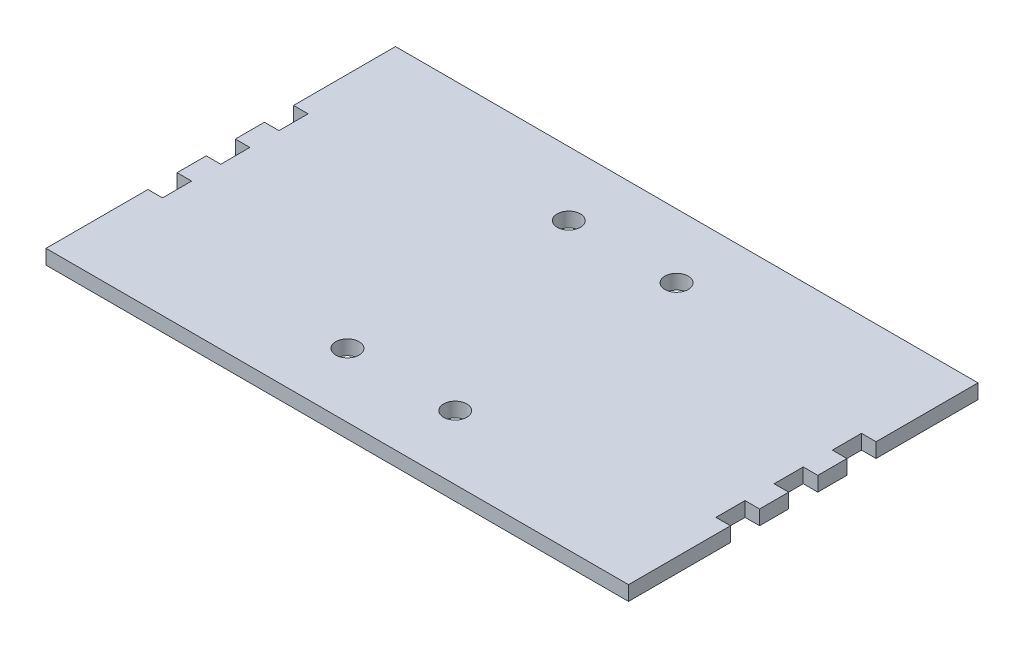
ISO-10303-21;
HEADER;
FILE_DESCRIPTION(('STEP AP214'),'2;1');
FILE_NAME('part.step','',(''),(''),'','','');
FILE_SCHEMA(('AUTOMOTIVE_DESIGN { 1 0 10303 214 1 1 1 1 }'));
ENDSEC;
DATA;
#1=APPLICATION_CONTEXT('core data for automotive mechanical design processes');
#2=APPLICATION_PROTOCOL_DEFINITION('international standard','automotive_design',2000,#1);
#3=PRODUCT_CONTEXT('',#1,'mechanical');
#4=PRODUCT('Part','Part','',(#3));
#5=PRODUCT_RELATED_PRODUCT_CATEGORY('part','',(#4));
#6=PRODUCT_DEFINITION_FORMATION('','',#4);
#7=PRODUCT_DEFINITION_CONTEXT('part definition',#1,'design');
#8=PRODUCT_DEFINITION('design','',#6,#7);
#9=PRODUCT_DEFINITION_SHAPE('','',#8);
#10=(LENGTH_UNIT() NAMED_UNIT(*) SI_UNIT(.MILLI.,.METRE.));
#11=(NAMED_UNIT(*) PLANE_ANGLE_UNIT() SI_UNIT($,.RADIAN.));
#12=(NAMED_UNIT(*) SI_UNIT($,.STERADIAN.) SOLID_ANGLE_UNIT());
#13=UNCERTAINTY_MEASURE_WITH_UNIT(LENGTH_MEASURE(1.E-05),#10,'distance_accuracy_value','');
#14=(GEOMETRIC_REPRESENTATION_CONTEXT(3) GLOBAL_UNCERTAINTY_ASSIGNED_CONTEXT((#13)) GLOBAL_UNIT_ASSIGNED_CONTEXT((#10,
#11,#12)) REPRESENTATION_CONTEXT('',''));
#15=CARTESIAN_POINT('',(0.,0.,0.));
#16=DIRECTION('',(0.,0.,1.));
#17=DIRECTION('',(1.,0.,0.));
#18=AXIS2_PLACEMENT_3D('',#15,#16,#17);
#19=CARTESIAN_POINT('',(100.,5.,60.));
#20=DIRECTION('',(-1.,0.,0.));
#21=DIRECTION('',(0.,0.,1.));
#22=AXIS2_PLACEMENT_3D('',#19,#20,#21);
#23=PLANE('',#22);
#24=DIRECTION('',(0.,0.,-1.));
#25=VECTOR('',#24,1.);
#26=CARTESIAN_POINT('',(100.,0.,60.));
#27=LINE('',#26,#25);
#28=CARTESIAN_POINT('',(100.,0.,-5.));
#29=VERTEX_POINT('',#28);
#30=CARTESIAN_POINT('',(100.,0.,-15.));
#31=VERTEX_POINT('',#30);
#32=EDGE_CURVE('E242',#29,#31,#27,.T.);
#33=ORIENTED_EDGE('',*,*,#32,.T.);
#34=DIRECTION('',(0.,1.,0.));
#35=VECTOR('',#34,1.);
#36=CARTESIAN_POINT('',(100.,0.,-15.));
#37=LINE('',#36,#35);
#38=CARTESIAN_POINT('',(100.,5.,-15.));
#39=VERTEX_POINT('',#38);
#40=EDGE_CURVE('E468',#31,#39,#37,.T.);
#41=ORIENTED_EDGE('',*,*,#40,.T.);
#42=DIRECTION('',(0.,0.,-1.));
#43=VECTOR('',#42,1.);
#44=CARTESIAN_POINT('',(100.,5.,60.));
#45=LINE('',#44,#43);
#46=CARTESIAN_POINT('',(100.,5.,-5.));
#47=VERTEX_POINT('',#46);
#48=EDGE_CURVE('E392',#47,#39,#45,.T.);
#49=ORIENTED_EDGE('',*,*,#48,.F.);
#50=DIRECTION('',(0.,1.,0.));
#51=VECTOR('',#50,1.);
#52=CARTESIAN_POINT('',(100.,0.,-5.));
#53=LINE('',#52,#51);
#54=EDGE_CURVE('E375',#29,#47,#53,.T.);
#55=ORIENTED_EDGE('',*,*,#54,.F.);
#56=EDGE_LOOP('',(#33,#41,#49,#55));
#57=FACE_BOUND('',#56,.T.);
#58=ADVANCED_FACE('F35',(#57),#23,.F.);
#59=CARTESIAN_POINT('',(100.,0.,60.));
#60=VERTEX_POINT('',#59);
#61=CARTESIAN_POINT('',(100.,0.,25.));
#62=VERTEX_POINT('',#61);
#63=EDGE_CURVE('E246',#60,#62,#27,.T.);
#64=ORIENTED_EDGE('',*,*,#63,.T.);
#65=DIRECTION('',(0.,1.,0.));
#66=VECTOR('',#65,1.);
#67=CARTESIAN_POINT('',(100.,0.,25.));
#68=LINE('',#67,#66);
#69=CARTESIAN_POINT('',(100.,5.,25.));
#70=VERTEX_POINT('',#69);
#71=EDGE_CURVE('E301',#62,#70,#68,.T.);
#72=ORIENTED_EDGE('',*,*,#71,.T.);
#73=CARTESIAN_POINT('',(100.,5.,60.));
#74=VERTEX_POINT('',#73);
#75=EDGE_CURVE('E387',#74,#70,#45,.T.);
#76=ORIENTED_EDGE('',*,*,#75,.F.);
#77=DIRECTION('',(0.,-1.,0.));
#78=VECTOR('',#77,1.);
#79=CARTESIAN_POINT('',(100.,5.,60.));
#80=LINE('',#79,#78);
#81=EDGE_CURVE('E270',#74,#60,#80,.T.);
#82=ORIENTED_EDGE('',*,*,#81,.T.);
#83=EDGE_LOOP('',(#64,#72,#76,#82));
#84=FACE_BOUND('',#83,.T.);
#85=ADVANCED_FACE('F410',(#84),#23,.F.);
#86=CARTESIAN_POINT('',(-100.,5.,60.));
#87=DIRECTION('',(1.,0.,0.));
#88=DIRECTION('',(0.,0.,-1.));
#89=AXIS2_PLACEMENT_3D('',#86,#87,#88);
#90=PLANE('',#89);
#91=DIRECTION('',(0.,0.,1.));
#92=VECTOR('',#91,1.);
#93=CARTESIAN_POINT('',(-100.,0.,60.));
#94=LINE('',#93,#92);
#95=CARTESIAN_POINT('',(-100.,0.,-60.));
#96=VERTEX_POINT('',#95);
#97=CARTESIAN_POINT('',(-100.,0.,-25.));
#98=VERTEX_POINT('',#97);
#99=EDGE_CURVE('E265',#96,#98,#94,.T.);
#100=ORIENTED_EDGE('',*,*,#99,.T.);
#101=DIRECTION('',(0.,1.,0.));
#102=VECTOR('',#101,1.);
#103=CARTESIAN_POINT('',(-100.,0.,-25.));
#104=LINE('',#103,#102);
#105=CARTESIAN_POINT('',(-100.,5.,-25.));
#106=VERTEX_POINT('',#105);
#107=EDGE_CURVE('E306',#98,#106,#104,.T.);
#108=ORIENTED_EDGE('',*,*,#107,.T.);
#109=DIRECTION('',(0.,0.,1.));
#110=VECTOR('',#109,1.);
#111=CARTESIAN_POINT('',(-100.,5.,60.));
#112=LINE('',#111,#110);
#113=CARTESIAN_POINT('',(-100.,5.,-60.));
#114=VERTEX_POINT('',#113);
#115=EDGE_CURVE('E280',#114,#106,#112,.T.);
#116=ORIENTED_EDGE('',*,*,#115,.F.);
#117=DIRECTION('',(0.,-1.,0.));
#118=VECTOR('',#117,1.);
#119=CARTESIAN_POINT('',(-100.,5.,-60.));
#120=LINE('',#119,#118);
#121=EDGE_CURVE('E43',#114,#96,#120,.T.);
#122=ORIENTED_EDGE('',*,*,#121,.T.);
#123=EDGE_LOOP('',(#100,#108,#116,#122));
#124=FACE_BOUND('',#123,.T.);
#125=ADVANCED_FACE('F277',(#124),#90,.F.);
#126=CARTESIAN_POINT('',(-100.,0.,5.00000000000001));
#127=VERTEX_POINT('',#126);
#128=CARTESIAN_POINT('',(-100.,0.,15.));
#129=VERTEX_POINT('',#128);
#130=EDGE_CURVE('E262',#127,#129,#94,.T.);
#131=ORIENTED_EDGE('',*,*,#130,.T.);
#132=DIRECTION('',(0.,1.,0.));
#133=VECTOR('',#132,1.);
#134=CARTESIAN_POINT('',(-100.,0.,15.));
#135=LINE('',#134,#133);
#136=CARTESIAN_POINT('',(-100.,5.,15.));
#137=VERTEX_POINT('',#136);
#138=EDGE_CURVE('E329',#129,#137,#135,.T.);
#139=ORIENTED_EDGE('',*,*,#138,.T.);
#140=CARTESIAN_POINT('',(-100.,5.,5.00000000000001));
#141=VERTEX_POINT('',#140);
#142=EDGE_CURVE('E396',#141,#137,#112,.T.);
#143=ORIENTED_EDGE('',*,*,#142,.F.);
#144=DIRECTION('',(0.,1.,0.));
#145=VECTOR('',#144,1.);
#146=CARTESIAN_POINT('',(-100.,0.,5.00000000000001));
#147=LINE('',#146,#145);
#148=EDGE_CURVE('E348',#127,#141,#147,.T.);
#149=ORIENTED_EDGE('',*,*,#148,.F.);
#150=EDGE_LOOP('',(#131,#139,#143,#149));
#151=FACE_BOUND('',#150,.T.);
#152=ADVANCED_FACE('F445',(#151),#90,.F.);
#153=CARTESIAN_POINT('',(-100.,5.,-15.));
#154=VERTEX_POINT('',#153);
#155=CARTESIAN_POINT('',(-100.,5.,-4.99999999999999));
#156=VERTEX_POINT('',#155);
#157=EDGE_CURVE('E395',#154,#156,#112,.T.);
#158=ORIENTED_EDGE('',*,*,#157,.F.);
#159=DIRECTION('',(0.,1.,0.));
#160=VECTOR('',#159,1.);
#161=CARTESIAN_POINT('',(-100.,0.,-15.));
#162=LINE('',#161,#160);
#163=CARTESIAN_POINT('',(-100.,0.,-15.));
#164=VERTEX_POINT('',#163);
#165=EDGE_CURVE('E289',#164,#154,#162,.T.);
#166=ORIENTED_EDGE('',*,*,#165,.F.);
#167=CARTESIAN_POINT('',(-100.,0.,-4.99999999999999));
#168=VERTEX_POINT('',#167);
#169=EDGE_CURVE('E264',#164,#168,#94,.T.);
#170=ORIENTED_EDGE('',*,*,#169,.T.);
#171=DIRECTION('',(0.,1.,0.));
#172=VECTOR('',#171,1.);
#173=CARTESIAN_POINT('',(-100.,0.,-4.99999999999999));
#174=LINE('',#173,#172);
#175=EDGE_CURVE('E356',#168,#156,#174,.T.);
#176=ORIENTED_EDGE('',*,*,#175,.T.);
#177=EDGE_LOOP('',(#158,#166,#170,#176));
#178=FACE_BOUND('',#177,.T.);
#179=ADVANCED_FACE('F433',(#178),#90,.F.);
#180=CARTESIAN_POINT('',(100.,5.,15.));
#181=VERTEX_POINT('',#180);
#182=CARTESIAN_POINT('',(100.,5.,5.));
#183=VERTEX_POINT('',#182);
#184=EDGE_CURVE('E391',#181,#183,#45,.T.);
#185=ORIENTED_EDGE('',*,*,#184,.F.);
#186=DIRECTION('',(0.,1.,0.));
#187=VECTOR('',#186,1.);
#188=CARTESIAN_POINT('',(100.,0.,15.));
#189=LINE('',#188,#187);
#190=CARTESIAN_POINT('',(100.,0.,15.));
#191=VERTEX_POINT('',#190);
#192=EDGE_CURVE('E423',#191,#181,#189,.T.);
#193=ORIENTED_EDGE('',*,*,#192,.F.);
#194=CARTESIAN_POINT('',(100.,0.,5.));
#195=VERTEX_POINT('',#194);
#196=EDGE_CURVE('E245',#191,#195,#27,.T.);
#197=ORIENTED_EDGE('',*,*,#196,.T.);
#198=DIRECTION('',(0.,1.,0.));
#199=VECTOR('',#198,1.);
#200=CARTESIAN_POINT('',(100.,0.,5.));
#201=LINE('',#200,#199);
#202=EDGE_CURVE('E243',#195,#183,#201,.T.);
#203=ORIENTED_EDGE('',*,*,#202,.T.);
#204=EDGE_LOOP('',(#185,#193,#197,#203));
#205=FACE_BOUND('',#204,.T.);
#206=ADVANCED_FACE('F549',(#205),#23,.F.);
#207=CARTESIAN_POINT('',(100.,5.,-25.));
#208=VERTEX_POINT('',#207);
#209=CARTESIAN_POINT('',(100.,5.,-60.));
#210=VERTEX_POINT('',#209);
#211=EDGE_CURVE('E235',#208,#210,#45,.T.);
#212=ORIENTED_EDGE('',*,*,#211,.F.);
#213=DIRECTION('',(0.,1.,0.));
#214=VECTOR('',#213,1.);
#215=CARTESIAN_POINT('',(100.,0.,-25.));
#216=LINE('',#215,#214);
#217=CARTESIAN_POINT('',(100.,0.,-25.));
#218=VERTEX_POINT('',#217);
#219=EDGE_CURVE('E223',#218,#208,#216,.T.);
#220=ORIENTED_EDGE('',*,*,#219,.F.);
#221=CARTESIAN_POINT('',(100.,0.,-60.));
#222=VERTEX_POINT('',#221);
#223=EDGE_CURVE('E233',#218,#222,#27,.T.);
#224=ORIENTED_EDGE('',*,*,#223,.T.);
#225=DIRECTION('',(0.,-1.,0.));
#226=VECTOR('',#225,1.);
#227=CARTESIAN_POINT('',(100.,5.,-60.));
#228=LINE('',#227,#226);
#229=EDGE_CURVE('E11',#210,#222,#228,.T.);
#230=ORIENTED_EDGE('',*,*,#229,.F.);
#231=EDGE_LOOP('',(#212,#220,#224,#230));
#232=FACE_BOUND('',#231,.T.);
#233=ADVANCED_FACE('F37',(#232),#23,.F.);
#234=CARTESIAN_POINT('',(-100.,5.,-60.));
#235=DIRECTION('',(0.,0.,1.));
#236=DIRECTION('',(1.,0.,0.));
#237=AXIS2_PLACEMENT_3D('',#234,#235,#236);
#238=PLANE('',#237);
#239=DIRECTION('',(-1.,0.,0.));
#240=VECTOR('',#239,1.);
#241=CARTESIAN_POINT('',(-100.,0.,-60.));
#242=LINE('',#241,#240);
#243=EDGE_CURVE('E241',#222,#96,#242,.T.);
#244=ORIENTED_EDGE('',*,*,#243,.T.);
#245=ORIENTED_EDGE('',*,*,#121,.F.);
#246=DIRECTION('',(-1.,0.,0.));
#247=VECTOR('',#246,1.);
#248=CARTESIAN_POINT('',(-100.,5.,-60.));
#249=LINE('',#248,#247);
#250=EDGE_CURVE('E390',#210,#114,#249,.T.);
#251=ORIENTED_EDGE('',*,*,#250,.F.);
#252=ORIENTED_EDGE('',*,*,#229,.T.);
#253=EDGE_LOOP('',(#244,#245,#251,#252));
#254=FACE_BOUND('',#253,.T.);
#255=ADVANCED_FACE('F551',(#254),#238,.F.);
#256=CARTESIAN_POINT('',(-100.,5.,25.));
#257=VERTEX_POINT('',#256);
#258=CARTESIAN_POINT('',(-100.,5.,60.));
#259=VERTEX_POINT('',#258);
#260=EDGE_CURVE('E394',#257,#259,#112,.T.);
#261=ORIENTED_EDGE('',*,*,#260,.F.);
#262=DIRECTION('',(0.,1.,0.));
#263=VECTOR('',#262,1.);
#264=CARTESIAN_POINT('',(-100.,0.,25.));
#265=LINE('',#264,#263);
#266=CARTESIAN_POINT('',(-100.,0.,25.));
#267=VERTEX_POINT('',#266);
#268=EDGE_CURVE('E322',#267,#257,#265,.T.);
#269=ORIENTED_EDGE('',*,*,#268,.F.);
#270=CARTESIAN_POINT('',(-100.,0.,60.));
#271=VERTEX_POINT('',#270);
#272=EDGE_CURVE('E258',#267,#271,#94,.T.);
#273=ORIENTED_EDGE('',*,*,#272,.T.);
#274=DIRECTION('',(0.,-1.,0.));
#275=VECTOR('',#274,1.);
#276=CARTESIAN_POINT('',(-100.,5.,60.));
#277=LINE('',#276,#275);
#278=EDGE_CURVE('E272',#259,#271,#277,.T.);
#279=ORIENTED_EDGE('',*,*,#278,.F.);
#280=EDGE_LOOP('',(#261,#269,#273,#279));
#281=FACE_BOUND('',#280,.T.);
#282=ADVANCED_FACE('F458',(#281),#90,.F.);
#283=CARTESIAN_POINT('',(-100.,5.,60.));
#284=DIRECTION('',(0.,0.,-1.));
#285=DIRECTION('',(-1.,0.,0.));
#286=AXIS2_PLACEMENT_3D('',#283,#284,#285);
#287=PLANE('',#286);
#288=DIRECTION('',(1.,0.,0.));
#289=VECTOR('',#288,1.);
#290=CARTESIAN_POINT('',(-100.,0.,60.));
#291=LINE('',#290,#289);
#292=EDGE_CURVE('E268',#271,#60,#291,.T.);
#293=ORIENTED_EDGE('',*,*,#292,.T.);
#294=ORIENTED_EDGE('',*,*,#81,.F.);
#295=DIRECTION('',(1.,0.,0.));
#296=VECTOR('',#295,1.);
#297=CARTESIAN_POINT('',(-100.,5.,60.));
#298=LINE('',#297,#296);
#299=EDGE_CURVE('E273',#259,#74,#298,.T.);
#300=ORIENTED_EDGE('',*,*,#299,.F.);
#301=ORIENTED_EDGE('',*,*,#278,.T.);
#302=EDGE_LOOP('',(#293,#294,#300,#301));
#303=FACE_BOUND('',#302,.T.);
#304=ADVANCED_FACE('F408',(#303),#287,.F.);
#305=CARTESIAN_POINT('',(0.,5.,0.));
#306=DIRECTION('',(0.,-1.,0.));
#307=DIRECTION('',(0.,0.,-1.));
#308=AXIS2_PLACEMENT_3D('',#305,#306,#307);
#309=PLANE('',#308);
#310=CARTESIAN_POINT('',(-18.5,5.,38.));
#311=DIRECTION('',(0.,1.,0.));
#312=DIRECTION('',(0.,0.,-1.));
#313=AXIS2_PLACEMENT_3D('',#310,#311,#312);
#314=CIRCLE('',#313,4.0000000000002);
#315=CARTESIAN_POINT('',(-18.5,5.,33.9999999999998));
#316=VERTEX_POINT('',#315);
#317=EDGE_CURVE('E505',#316,#316,#314,.T.);
#318=ORIENTED_EDGE('',*,*,#317,.F.);
#319=EDGE_LOOP('',(#318));
#320=FACE_BOUND('',#319,.T.);
#321=CARTESIAN_POINT('',(18.5,5.,38.));
#322=DIRECTION('',(0.,1.,0.));
#323=DIRECTION('',(0.,0.,1.));
#324=AXIS2_PLACEMENT_3D('',#321,#322,#323);
#325=CIRCLE('',#324,4.0000000000002);
#326=CARTESIAN_POINT('',(18.5,5.,42.0000000000002));
#327=VERTEX_POINT('',#326);
#328=EDGE_CURVE('E499',#327,#327,#325,.T.);
#329=ORIENTED_EDGE('',*,*,#328,.F.);
#330=EDGE_LOOP('',(#329));
#331=FACE_BOUND('',#330,.T.);
#332=CARTESIAN_POINT('',(18.5,5.,-38.));
#333=DIRECTION('',(0.,1.,0.));
#334=DIRECTION('',(0.,0.,-1.));
#335=AXIS2_PLACEMENT_3D('',#332,#333,#334);
#336=CIRCLE('',#335,4.0000000000002);
#337=CARTESIAN_POINT('',(18.5,5.,-42.0000000000002));
#338=VERTEX_POINT('',#337);
#339=EDGE_CURVE('E493',#338,#338,#336,.T.);
#340=ORIENTED_EDGE('',*,*,#339,.F.);
#341=EDGE_LOOP('',(#340));
#342=FACE_BOUND('',#341,.T.);
#343=CARTESIAN_POINT('',(-18.5,5.,-38.));
#344=DIRECTION('',(0.,1.,0.));
#345=DIRECTION('',(0.,0.,1.));
#346=AXIS2_PLACEMENT_3D('',#343,#344,#345);
#347=CIRCLE('',#346,4.0000000000002);
#348=CARTESIAN_POINT('',(-18.5,5.,-33.9999999999998));
#349=VERTEX_POINT('',#348);
#350=EDGE_CURVE('E487',#349,#349,#347,.T.);
#351=ORIENTED_EDGE('',*,*,#350,.F.);
#352=EDGE_LOOP('',(#351));
#353=FACE_BOUND('',#352,.T.);
#354=ORIENTED_EDGE('',*,*,#48,.T.);
#355=DIRECTION('',(1.,0.,0.));
#356=VECTOR('',#355,1.);
#357=CARTESIAN_POINT('',(100.,5.,-15.));
#358=LINE('',#357,#356);
#359=CARTESIAN_POINT('',(95.,5.,-15.));
#360=VERTEX_POINT('',#359);
#361=EDGE_CURVE('E228',#360,#39,#358,.T.);
#362=ORIENTED_EDGE('',*,*,#361,.F.);
#363=DIRECTION('',(0.,0.,1.));
#364=VECTOR('',#363,1.);
#365=CARTESIAN_POINT('',(95.,5.,-15.));
#366=LINE('',#365,#364);
#367=CARTESIAN_POINT('',(95.,5.,-25.));
#368=VERTEX_POINT('',#367);
#369=EDGE_CURVE('E479',#368,#360,#366,.T.);
#370=ORIENTED_EDGE('',*,*,#369,.F.);
#371=DIRECTION('',(-1.,0.,0.));
#372=VECTOR('',#371,1.);
#373=CARTESIAN_POINT('',(100.,5.,-25.));
#374=LINE('',#373,#372);
#375=EDGE_CURVE('E482',#208,#368,#374,.T.);
#376=ORIENTED_EDGE('',*,*,#375,.F.);
#377=ORIENTED_EDGE('',*,*,#211,.T.);
#378=ORIENTED_EDGE('',*,*,#250,.T.);
#379=ORIENTED_EDGE('',*,*,#115,.T.);
#380=DIRECTION('',(-1.,0.,0.));
#381=VECTOR('',#380,1.);
#382=CARTESIAN_POINT('',(-100.,5.,-25.));
#383=LINE('',#382,#381);
#384=CARTESIAN_POINT('',(-95.,5.,-25.));
#385=VERTEX_POINT('',#384);
#386=EDGE_CURVE('E304',#385,#106,#383,.T.);
#387=ORIENTED_EDGE('',*,*,#386,.F.);
#388=DIRECTION('',(0.,0.,-1.));
#389=VECTOR('',#388,1.);
#390=CARTESIAN_POINT('',(-95.,5.,-15.));
#391=LINE('',#390,#389);
#392=CARTESIAN_POINT('',(-95.,5.,-15.));
#393=VERTEX_POINT('',#392);
#394=EDGE_CURVE('E300',#393,#385,#391,.T.);
#395=ORIENTED_EDGE('',*,*,#394,.F.);
#396=DIRECTION('',(1.,0.,0.));
#397=VECTOR('',#396,1.);
#398=CARTESIAN_POINT('',(-100.,5.,-15.));
#399=LINE('',#398,#397);
#400=EDGE_CURVE('E297',#154,#393,#399,.T.);
#401=ORIENTED_EDGE('',*,*,#400,.F.);
#402=ORIENTED_EDGE('',*,*,#157,.T.);
#403=DIRECTION('',(-1.,0.,0.));
#404=VECTOR('',#403,1.);
#405=CARTESIAN_POINT('',(-95.,5.,-4.99999999999999));
#406=LINE('',#405,#404);
#407=CARTESIAN_POINT('',(-95.,5.,-4.99999999999999));
#408=VERTEX_POINT('',#407);
#409=EDGE_CURVE('E342',#408,#156,#406,.T.);
#410=ORIENTED_EDGE('',*,*,#409,.F.);
#411=DIRECTION('',(0.,0.,-1.));
#412=VECTOR('',#411,1.);
#413=CARTESIAN_POINT('',(-95.,5.,5.00000000000001));
#414=LINE('',#413,#412);
#415=CARTESIAN_POINT('',(-95.,5.,5.00000000000001));
#416=VERTEX_POINT('',#415);
#417=EDGE_CURVE('E351',#416,#408,#414,.T.);
#418=ORIENTED_EDGE('',*,*,#417,.F.);
#419=DIRECTION('',(1.,0.,0.));
#420=VECTOR('',#419,1.);
#421=CARTESIAN_POINT('',(-95.,5.,5.00000000000001));
#422=LINE('',#421,#420);
#423=EDGE_CURVE('E332',#141,#416,#422,.T.);
#424=ORIENTED_EDGE('',*,*,#423,.F.);
#425=ORIENTED_EDGE('',*,*,#142,.T.);
#426=DIRECTION('',(-1.,0.,0.));
#427=VECTOR('',#426,1.);
#428=CARTESIAN_POINT('',(-100.,5.,15.));
#429=LINE('',#428,#427);
#430=CARTESIAN_POINT('',(-95.,5.,15.));
#431=VERTEX_POINT('',#430);
#432=EDGE_CURVE('E316',#431,#137,#429,.T.);
#433=ORIENTED_EDGE('',*,*,#432,.F.);
#434=DIRECTION('',(0.,0.,-1.));
#435=VECTOR('',#434,1.);
#436=CARTESIAN_POINT('',(-95.,5.,25.));
#437=LINE('',#436,#435);
#438=CARTESIAN_POINT('',(-95.,5.,25.));
#439=VERTEX_POINT('',#438);
#440=EDGE_CURVE('E325',#439,#431,#437,.T.);
#441=ORIENTED_EDGE('',*,*,#440,.F.);
#442=DIRECTION('',(1.,0.,0.));
#443=VECTOR('',#442,1.);
#444=CARTESIAN_POINT('',(-100.,5.,25.));
#445=LINE('',#444,#443);
#446=EDGE_CURVE('E308',#257,#439,#445,.T.);
#447=ORIENTED_EDGE('',*,*,#446,.F.);
#448=ORIENTED_EDGE('',*,*,#260,.T.);
#449=ORIENTED_EDGE('',*,*,#299,.T.);
#450=ORIENTED_EDGE('',*,*,#75,.T.);
#451=DIRECTION('',(1.,0.,0.));
#452=VECTOR('',#451,1.);
#453=CARTESIAN_POINT('',(100.,5.,25.));
#454=LINE('',#453,#452);
#455=CARTESIAN_POINT('',(95.,5.,25.));
#456=VERTEX_POINT('',#455);
#457=EDGE_CURVE('E419',#456,#70,#454,.T.);
#458=ORIENTED_EDGE('',*,*,#457,.F.);
#459=DIRECTION('',(0.,0.,1.));
#460=VECTOR('',#459,1.);
#461=CARTESIAN_POINT('',(95.,5.,25.));
#462=LINE('',#461,#460);
#463=CARTESIAN_POINT('',(95.,5.,15.));
#464=VERTEX_POINT('',#463);
#465=EDGE_CURVE('E467',#464,#456,#462,.T.);
#466=ORIENTED_EDGE('',*,*,#465,.F.);
#467=DIRECTION('',(-1.,0.,0.));
#468=VECTOR('',#467,1.);
#469=CARTESIAN_POINT('',(100.,5.,15.));
#470=LINE('',#469,#468);
#471=EDGE_CURVE('E465',#181,#464,#470,.T.);
#472=ORIENTED_EDGE('',*,*,#471,.F.);
#473=ORIENTED_EDGE('',*,*,#184,.T.);
#474=DIRECTION('',(1.,0.,0.));
#475=VECTOR('',#474,1.);
#476=CARTESIAN_POINT('',(95.,5.,5.));
#477=LINE('',#476,#475);
#478=CARTESIAN_POINT('',(95.,5.,5.));
#479=VERTEX_POINT('',#478);
#480=EDGE_CURVE('E369',#479,#183,#477,.T.);
#481=ORIENTED_EDGE('',*,*,#480,.F.);
#482=DIRECTION('',(0.,0.,1.));
#483=VECTOR('',#482,1.);
#484=CARTESIAN_POINT('',(95.,5.,5.));
#485=LINE('',#484,#483);
#486=CARTESIAN_POINT('',(95.,5.,-5.));
#487=VERTEX_POINT('',#486);
#488=EDGE_CURVE('E378',#487,#479,#485,.T.);
#489=ORIENTED_EDGE('',*,*,#488,.F.);
#490=DIRECTION('',(-1.,0.,0.));
#491=VECTOR('',#490,1.);
#492=CARTESIAN_POINT('',(95.,5.,-5.));
#493=LINE('',#492,#491);
#494=EDGE_CURVE('E359',#47,#487,#493,.T.);
#495=ORIENTED_EDGE('',*,*,#494,.F.);
#496=EDGE_LOOP('',(#354,#362,#370,#376,#377,#378,#379,#387,#395,#401,#402,#410,#418,#424,#425,
#433,#441,#447,#448,#449,#450,#458,#466,#472,#473,#481,#489,#495));
#497=FACE_BOUND('',#496,.T.);
#498=ADVANCED_FACE('F401',(#320,#331,#342,#353,#497),#309,.F.);
#499=CARTESIAN_POINT('',(0.,0.,0.));
#500=DIRECTION('',(0.,-1.,0.));
#501=DIRECTION('',(0.,0.,-1.));
#502=AXIS2_PLACEMENT_3D('',#499,#500,#501);
#503=PLANE('',#502);
#504=CARTESIAN_POINT('',(-18.5,0.,38.));
#505=DIRECTION('',(0.,1.,0.));
#506=DIRECTION('',(0.,0.,-1.));
#507=AXIS2_PLACEMENT_3D('',#504,#505,#506);
#508=CIRCLE('',#507,4.0000000000002);
#509=CARTESIAN_POINT('',(-18.5,0.,33.9999999999998));
#510=VERTEX_POINT('',#509);
#511=EDGE_CURVE('E502',#510,#510,#508,.T.);
#512=ORIENTED_EDGE('',*,*,#511,.T.);
#513=EDGE_LOOP('',(#512));
#514=FACE_BOUND('',#513,.T.);
#515=CARTESIAN_POINT('',(18.5,0.,38.));
#516=DIRECTION('',(0.,1.,0.));
#517=DIRECTION('',(0.,0.,1.));
#518=AXIS2_PLACEMENT_3D('',#515,#516,#517);
#519=CIRCLE('',#518,4.0000000000002);
#520=CARTESIAN_POINT('',(18.5,0.,42.0000000000002));
#521=VERTEX_POINT('',#520);
#522=EDGE_CURVE('E496',#521,#521,#519,.T.);
#523=ORIENTED_EDGE('',*,*,#522,.T.);
#524=EDGE_LOOP('',(#523));
#525=FACE_BOUND('',#524,.T.);
#526=CARTESIAN_POINT('',(18.5,0.,-38.));
#527=DIRECTION('',(0.,1.,0.));
#528=DIRECTION('',(0.,0.,-1.));
#529=AXIS2_PLACEMENT_3D('',#526,#527,#528);
#530=CIRCLE('',#529,4.0000000000002);
#531=CARTESIAN_POINT('',(18.5,0.,-42.0000000000002));
#532=VERTEX_POINT('',#531);
#533=EDGE_CURVE('E490',#532,#532,#530,.T.);
#534=ORIENTED_EDGE('',*,*,#533,.T.);
#535=EDGE_LOOP('',(#534));
#536=FACE_BOUND('',#535,.T.);
#537=CARTESIAN_POINT('',(-18.5,0.,-38.));
#538=DIRECTION('',(0.,1.,0.));
#539=DIRECTION('',(0.,0.,1.));
#540=AXIS2_PLACEMENT_3D('',#537,#538,#539);
#541=CIRCLE('',#540,4.0000000000002);
#542=CARTESIAN_POINT('',(-18.5,0.,-33.9999999999998));
#543=VERTEX_POINT('',#542);
#544=EDGE_CURVE('E484',#543,#543,#541,.T.);
#545=ORIENTED_EDGE('',*,*,#544,.T.);
#546=EDGE_LOOP('',(#545));
#547=FACE_BOUND('',#546,.T.);
#548=DIRECTION('',(1.,0.,0.));
#549=VECTOR('',#548,1.);
#550=CARTESIAN_POINT('',(100.,0.,-15.));
#551=LINE('',#550,#549);
#552=CARTESIAN_POINT('',(95.,0.,-15.));
#553=VERTEX_POINT('',#552);
#554=EDGE_CURVE('E236',#553,#31,#551,.T.);
#555=ORIENTED_EDGE('',*,*,#554,.T.);
#556=ORIENTED_EDGE('',*,*,#32,.F.);
#557=DIRECTION('',(-1.,0.,0.));
#558=VECTOR('',#557,1.);
#559=CARTESIAN_POINT('',(95.,0.,-5.));
#560=LINE('',#559,#558);
#561=CARTESIAN_POINT('',(95.,0.,-5.));
#562=VERTEX_POINT('',#561);
#563=EDGE_CURVE('E365',#29,#562,#560,.T.);
#564=ORIENTED_EDGE('',*,*,#563,.T.);
#565=DIRECTION('',(0.,0.,1.));
#566=VECTOR('',#565,1.);
#567=CARTESIAN_POINT('',(95.,0.,5.));
#568=LINE('',#567,#566);
#569=CARTESIAN_POINT('',(95.,0.,5.));
#570=VERTEX_POINT('',#569);
#571=EDGE_CURVE('E368',#562,#570,#568,.T.);
#572=ORIENTED_EDGE('',*,*,#571,.T.);
#573=DIRECTION('',(1.,0.,0.));
#574=VECTOR('',#573,1.);
#575=CARTESIAN_POINT('',(95.,0.,5.));
#576=LINE('',#575,#574);
#577=EDGE_CURVE('E372',#570,#195,#576,.T.);
#578=ORIENTED_EDGE('',*,*,#577,.T.);
#579=ORIENTED_EDGE('',*,*,#196,.F.);
#580=DIRECTION('',(-1.,0.,0.));
#581=VECTOR('',#580,1.);
#582=CARTESIAN_POINT('',(100.,0.,15.));
#583=LINE('',#582,#581);
#584=CARTESIAN_POINT('',(95.,0.,15.));
#585=VERTEX_POINT('',#584);
#586=EDGE_CURVE('E461',#191,#585,#583,.T.);
#587=ORIENTED_EDGE('',*,*,#586,.T.);
#588=DIRECTION('',(0.,0.,1.));
#589=VECTOR('',#588,1.);
#590=CARTESIAN_POINT('',(95.,0.,25.));
#591=LINE('',#590,#589);
#592=CARTESIAN_POINT('',(95.,0.,25.));
#593=VERTEX_POINT('',#592);
#594=EDGE_CURVE('E58',#585,#593,#591,.T.);
#595=ORIENTED_EDGE('',*,*,#594,.T.);
#596=DIRECTION('',(1.,0.,0.));
#597=VECTOR('',#596,1.);
#598=CARTESIAN_POINT('',(100.,0.,25.));
#599=LINE('',#598,#597);
#600=EDGE_CURVE('E424',#593,#62,#599,.T.);
#601=ORIENTED_EDGE('',*,*,#600,.T.);
#602=ORIENTED_EDGE('',*,*,#63,.F.);
#603=ORIENTED_EDGE('',*,*,#292,.F.);
#604=ORIENTED_EDGE('',*,*,#272,.F.);
#605=DIRECTION('',(1.,0.,0.));
#606=VECTOR('',#605,1.);
#607=CARTESIAN_POINT('',(-100.,0.,25.));
#608=LINE('',#607,#606);
#609=CARTESIAN_POINT('',(-95.,0.,25.));
#610=VERTEX_POINT('',#609);
#611=EDGE_CURVE('E312',#267,#610,#608,.T.);
#612=ORIENTED_EDGE('',*,*,#611,.T.);
#613=DIRECTION('',(0.,0.,-1.));
#614=VECTOR('',#613,1.);
#615=CARTESIAN_POINT('',(-95.,0.,25.));
#616=LINE('',#615,#614);
#617=CARTESIAN_POINT('',(-95.,0.,15.));
#618=VERTEX_POINT('',#617);
#619=EDGE_CURVE('E315',#610,#618,#616,.T.);
#620=ORIENTED_EDGE('',*,*,#619,.T.);
#621=DIRECTION('',(-1.,0.,0.));
#622=VECTOR('',#621,1.);
#623=CARTESIAN_POINT('',(-100.,0.,15.));
#624=LINE('',#623,#622);
#625=EDGE_CURVE('E319',#618,#129,#624,.T.);
#626=ORIENTED_EDGE('',*,*,#625,.T.);
#627=ORIENTED_EDGE('',*,*,#130,.F.);
#628=DIRECTION('',(1.,0.,0.));
#629=VECTOR('',#628,1.);
#630=CARTESIAN_POINT('',(-95.,0.,5.00000000000001));
#631=LINE('',#630,#629);
#632=CARTESIAN_POINT('',(-95.,0.,5.00000000000001));
#633=VERTEX_POINT('',#632);
#634=EDGE_CURVE('E338',#127,#633,#631,.T.);
#635=ORIENTED_EDGE('',*,*,#634,.T.);
#636=DIRECTION('',(0.,0.,-1.));
#637=VECTOR('',#636,1.);
#638=CARTESIAN_POINT('',(-95.,0.,5.00000000000001));
#639=LINE('',#638,#637);
#640=CARTESIAN_POINT('',(-95.,0.,-4.99999999999999));
#641=VERTEX_POINT('',#640);
#642=EDGE_CURVE('E341',#633,#641,#639,.T.);
#643=ORIENTED_EDGE('',*,*,#642,.T.);
#644=DIRECTION('',(-1.,0.,0.));
#645=VECTOR('',#644,1.);
#646=CARTESIAN_POINT('',(-95.,0.,-4.99999999999999));
#647=LINE('',#646,#645);
#648=EDGE_CURVE('E345',#641,#168,#647,.T.);
#649=ORIENTED_EDGE('',*,*,#648,.T.);
#650=ORIENTED_EDGE('',*,*,#169,.F.);
#651=DIRECTION('',(1.,0.,0.));
#652=VECTOR('',#651,1.);
#653=CARTESIAN_POINT('',(-100.,0.,-15.));
#654=LINE('',#653,#652);
#655=CARTESIAN_POINT('',(-95.,0.,-15.));
#656=VERTEX_POINT('',#655);
#657=EDGE_CURVE('E293',#164,#656,#654,.T.);
#658=ORIENTED_EDGE('',*,*,#657,.T.);
#659=DIRECTION('',(0.,0.,-1.));
#660=VECTOR('',#659,1.);
#661=CARTESIAN_POINT('',(-95.,0.,-15.));
#662=LINE('',#661,#660);
#663=CARTESIAN_POINT('',(-95.,0.,-25.));
#664=VERTEX_POINT('',#663);
#665=EDGE_CURVE('E287',#656,#664,#662,.T.);
#666=ORIENTED_EDGE('',*,*,#665,.T.);
#667=DIRECTION('',(-1.,0.,0.));
#668=VECTOR('',#667,1.);
#669=CARTESIAN_POINT('',(-100.,0.,-25.));
#670=LINE('',#669,#668);
#671=EDGE_CURVE('E285',#664,#98,#670,.T.);
#672=ORIENTED_EDGE('',*,*,#671,.T.);
#673=ORIENTED_EDGE('',*,*,#99,.F.);
#674=ORIENTED_EDGE('',*,*,#243,.F.);
#675=ORIENTED_EDGE('',*,*,#223,.F.);
#676=DIRECTION('',(-1.,0.,0.));
#677=VECTOR('',#676,1.);
#678=CARTESIAN_POINT('',(100.,0.,-25.));
#679=LINE('',#678,#677);
#680=CARTESIAN_POINT('',(95.,0.,-25.));
#681=VERTEX_POINT('',#680);
#682=EDGE_CURVE('E219',#218,#681,#679,.T.);
#683=ORIENTED_EDGE('',*,*,#682,.T.);
#684=DIRECTION('',(0.,0.,1.));
#685=VECTOR('',#684,1.);
#686=CARTESIAN_POINT('',(95.,0.,-15.));
#687=LINE('',#686,#685);
#688=EDGE_CURVE('E50',#681,#553,#687,.T.);
#689=ORIENTED_EDGE('',*,*,#688,.T.);
#690=EDGE_LOOP('',(#555,#556,#564,#572,#578,#579,#587,#595,#601,#602,#603,#604,#612,#620,#626,
#627,#635,#643,#649,#650,#658,#666,#672,#673,#674,#675,#683,#689));
#691=FACE_BOUND('',#690,.T.);
#692=ADVANCED_FACE('F239',(#514,#525,#536,#547,#691),#503,.T.);
#693=CARTESIAN_POINT('',(95.,0.,5.));
#694=DIRECTION('',(0.,0.,1.));
#695=DIRECTION('',(1.,0.,0.));
#696=AXIS2_PLACEMENT_3D('',#693,#694,#695);
#697=PLANE('',#696);
#698=ORIENTED_EDGE('',*,*,#480,.T.);
#699=ORIENTED_EDGE('',*,*,#202,.F.);
#700=ORIENTED_EDGE('',*,*,#577,.F.);
#701=DIRECTION('',(0.,1.,0.));
#702=VECTOR('',#701,1.);
#703=CARTESIAN_POINT('',(95.,0.,5.));
#704=LINE('',#703,#702);
#705=EDGE_CURVE('E249',#570,#479,#704,.T.);
#706=ORIENTED_EDGE('',*,*,#705,.T.);
#707=EDGE_LOOP('',(#698,#699,#700,#706));
#708=FACE_BOUND('',#707,.T.);
#709=ADVANCED_FACE('F583',(#708),#697,.F.);
#710=CARTESIAN_POINT('',(95.,0.,5.));
#711=DIRECTION('',(-1.,0.,0.));
#712=DIRECTION('',(0.,0.,1.));
#713=AXIS2_PLACEMENT_3D('',#710,#711,#712);
#714=PLANE('',#713);
#715=ORIENTED_EDGE('',*,*,#488,.T.);
#716=ORIENTED_EDGE('',*,*,#705,.F.);
#717=ORIENTED_EDGE('',*,*,#571,.F.);
#718=DIRECTION('',(0.,1.,0.));
#719=VECTOR('',#718,1.);
#720=CARTESIAN_POINT('',(95.,0.,-5.));
#721=LINE('',#720,#719);
#722=EDGE_CURVE('E384',#562,#487,#721,.T.);
#723=ORIENTED_EDGE('',*,*,#722,.T.);
#724=EDGE_LOOP('',(#715,#716,#717,#723));
#725=FACE_BOUND('',#724,.T.);
#726=ADVANCED_FACE('F580',(#725),#714,.F.);
#727=CARTESIAN_POINT('',(95.,0.,-5.));
#728=DIRECTION('',(0.,0.,-1.));
#729=DIRECTION('',(-1.,0.,0.));
#730=AXIS2_PLACEMENT_3D('',#727,#728,#729);
#731=PLANE('',#730);
#732=ORIENTED_EDGE('',*,*,#494,.T.);
#733=ORIENTED_EDGE('',*,*,#722,.F.);
#734=ORIENTED_EDGE('',*,*,#563,.F.);
#735=ORIENTED_EDGE('',*,*,#54,.T.);
#736=EDGE_LOOP('',(#732,#733,#734,#735));
#737=FACE_BOUND('',#736,.T.);
#738=ADVANCED_FACE('F576',(#737),#731,.F.);
#739=CARTESIAN_POINT('',(-95.,0.,-4.99999999999999));
#740=DIRECTION('',(0.,0.,-1.));
#741=DIRECTION('',(-1.,0.,0.));
#742=AXIS2_PLACEMENT_3D('',#739,#740,#741);
#743=PLANE('',#742);
#744=ORIENTED_EDGE('',*,*,#409,.T.);
#745=ORIENTED_EDGE('',*,*,#175,.F.);
#746=ORIENTED_EDGE('',*,*,#648,.F.);
#747=DIRECTION('',(0.,1.,0.));
#748=VECTOR('',#747,1.);
#749=CARTESIAN_POINT('',(-95.,0.,-4.99999999999999));
#750=LINE('',#749,#748);
#751=EDGE_CURVE('E360',#641,#408,#750,.T.);
#752=ORIENTED_EDGE('',*,*,#751,.T.);
#753=EDGE_LOOP('',(#744,#745,#746,#752));
#754=FACE_BOUND('',#753,.T.);
#755=ADVANCED_FACE('F598',(#754),#743,.F.);
#756=CARTESIAN_POINT('',(-95.,0.,5.00000000000001));
#757=DIRECTION('',(1.,0.,0.));
#758=DIRECTION('',(0.,0.,-1.));
#759=AXIS2_PLACEMENT_3D('',#756,#757,#758);
#760=PLANE('',#759);
#761=ORIENTED_EDGE('',*,*,#417,.T.);
#762=ORIENTED_EDGE('',*,*,#751,.F.);
#763=ORIENTED_EDGE('',*,*,#642,.F.);
#764=DIRECTION('',(0.,1.,0.));
#765=VECTOR('',#764,1.);
#766=CARTESIAN_POINT('',(-95.,0.,5.00000000000001));
#767=LINE('',#766,#765);
#768=EDGE_CURVE('E362',#633,#416,#767,.T.);
#769=ORIENTED_EDGE('',*,*,#768,.T.);
#770=EDGE_LOOP('',(#761,#762,#763,#769));
#771=FACE_BOUND('',#770,.T.);
#772=ADVANCED_FACE('F655',(#771),#760,.F.);
#773=CARTESIAN_POINT('',(-95.,0.,5.00000000000001));
#774=DIRECTION('',(0.,0.,1.));
#775=DIRECTION('',(1.,0.,0.));
#776=AXIS2_PLACEMENT_3D('',#773,#774,#775);
#777=PLANE('',#776);
#778=ORIENTED_EDGE('',*,*,#423,.T.);
#779=ORIENTED_EDGE('',*,*,#768,.F.);
#780=ORIENTED_EDGE('',*,*,#634,.F.);
#781=ORIENTED_EDGE('',*,*,#148,.T.);
#782=EDGE_LOOP('',(#778,#779,#780,#781));
#783=FACE_BOUND('',#782,.T.);
#784=ADVANCED_FACE('F594',(#783),#777,.F.);
#785=CARTESIAN_POINT('',(-100.,0.,15.));
#786=DIRECTION('',(0.,0.,-1.));
#787=DIRECTION('',(-1.,0.,0.));
#788=AXIS2_PLACEMENT_3D('',#785,#786,#787);
#789=PLANE('',#788);
#790=ORIENTED_EDGE('',*,*,#432,.T.);
#791=ORIENTED_EDGE('',*,*,#138,.F.);
#792=ORIENTED_EDGE('',*,*,#625,.F.);
#793=DIRECTION('',(0.,1.,0.));
#794=VECTOR('',#793,1.);
#795=CARTESIAN_POINT('',(-95.,0.,15.));
#796=LINE('',#795,#794);
#797=EDGE_CURVE('E333',#618,#431,#796,.T.);
#798=ORIENTED_EDGE('',*,*,#797,.T.);
#799=EDGE_LOOP('',(#790,#791,#792,#798));
#800=FACE_BOUND('',#799,.T.);
#801=ADVANCED_FACE('F449',(#800),#789,.F.);
#802=CARTESIAN_POINT('',(-95.,0.,25.));
#803=DIRECTION('',(1.,0.,0.));
#804=DIRECTION('',(0.,0.,-1.));
#805=AXIS2_PLACEMENT_3D('',#802,#803,#804);
#806=PLANE('',#805);
#807=ORIENTED_EDGE('',*,*,#440,.T.);
#808=ORIENTED_EDGE('',*,*,#797,.F.);
#809=ORIENTED_EDGE('',*,*,#619,.F.);
#810=DIRECTION('',(0.,1.,0.));
#811=VECTOR('',#810,1.);
#812=CARTESIAN_POINT('',(-95.,0.,25.));
#813=LINE('',#812,#811);
#814=EDGE_CURVE('E335',#610,#439,#813,.T.);
#815=ORIENTED_EDGE('',*,*,#814,.T.);
#816=EDGE_LOOP('',(#807,#808,#809,#815));
#817=FACE_BOUND('',#816,.T.);
#818=ADVANCED_FACE('F453',(#817),#806,.F.);
#819=CARTESIAN_POINT('',(-100.,0.,25.));
#820=DIRECTION('',(0.,0.,1.));
#821=DIRECTION('',(1.,0.,0.));
#822=AXIS2_PLACEMENT_3D('',#819,#820,#821);
#823=PLANE('',#822);
#824=ORIENTED_EDGE('',*,*,#446,.T.);
#825=ORIENTED_EDGE('',*,*,#814,.F.);
#826=ORIENTED_EDGE('',*,*,#611,.F.);
#827=ORIENTED_EDGE('',*,*,#268,.T.);
#828=EDGE_LOOP('',(#824,#825,#826,#827));
#829=FACE_BOUND('',#828,.T.);
#830=ADVANCED_FACE('F455',(#829),#823,.F.);
#831=CARTESIAN_POINT('',(-100.,0.,-25.));
#832=DIRECTION('',(0.,0.,-1.));
#833=DIRECTION('',(-1.,0.,0.));
#834=AXIS2_PLACEMENT_3D('',#831,#832,#833);
#835=PLANE('',#834);
#836=ORIENTED_EDGE('',*,*,#386,.T.);
#837=ORIENTED_EDGE('',*,*,#107,.F.);
#838=ORIENTED_EDGE('',*,*,#671,.F.);
#839=DIRECTION('',(0.,1.,0.));
#840=VECTOR('',#839,1.);
#841=CARTESIAN_POINT('',(-95.,0.,-25.));
#842=LINE('',#841,#840);
#843=EDGE_CURVE('E309',#664,#385,#842,.T.);
#844=ORIENTED_EDGE('',*,*,#843,.T.);
#845=EDGE_LOOP('',(#836,#837,#838,#844));
#846=FACE_BOUND('',#845,.T.);
#847=ADVANCED_FACE('F697',(#846),#835,.F.);
#848=CARTESIAN_POINT('',(-95.,0.,-15.));
#849=DIRECTION('',(1.,0.,0.));
#850=DIRECTION('',(0.,0.,-1.));
#851=AXIS2_PLACEMENT_3D('',#848,#849,#850);
#852=PLANE('',#851);
#853=ORIENTED_EDGE('',*,*,#394,.T.);
#854=ORIENTED_EDGE('',*,*,#843,.F.);
#855=ORIENTED_EDGE('',*,*,#665,.F.);
#856=DIRECTION('',(0.,1.,0.));
#857=VECTOR('',#856,1.);
#858=CARTESIAN_POINT('',(-95.,0.,-15.));
#859=LINE('',#858,#857);
#860=EDGE_CURVE('E291',#656,#393,#859,.T.);
#861=ORIENTED_EDGE('',*,*,#860,.T.);
#862=EDGE_LOOP('',(#853,#854,#855,#861));
#863=FACE_BOUND('',#862,.T.);
#864=ADVANCED_FACE('F706',(#863),#852,.F.);
#865=CARTESIAN_POINT('',(-100.,0.,-15.));
#866=DIRECTION('',(0.,0.,1.));
#867=DIRECTION('',(1.,0.,0.));
#868=AXIS2_PLACEMENT_3D('',#865,#866,#867);
#869=PLANE('',#868);
#870=ORIENTED_EDGE('',*,*,#400,.T.);
#871=ORIENTED_EDGE('',*,*,#860,.F.);
#872=ORIENTED_EDGE('',*,*,#657,.F.);
#873=ORIENTED_EDGE('',*,*,#165,.T.);
#874=EDGE_LOOP('',(#870,#871,#872,#873));
#875=FACE_BOUND('',#874,.T.);
#876=ADVANCED_FACE('F429',(#875),#869,.F.);
#877=CARTESIAN_POINT('',(100.,0.,25.));
#878=DIRECTION('',(0.,0.,1.));
#879=DIRECTION('',(1.,0.,0.));
#880=AXIS2_PLACEMENT_3D('',#877,#878,#879);
#881=PLANE('',#880);
#882=ORIENTED_EDGE('',*,*,#457,.T.);
#883=ORIENTED_EDGE('',*,*,#71,.F.);
#884=ORIENTED_EDGE('',*,*,#600,.F.);
#885=DIRECTION('',(0.,1.,0.));
#886=VECTOR('',#885,1.);
#887=CARTESIAN_POINT('',(95.,0.,25.));
#888=LINE('',#887,#886);
#889=EDGE_CURVE('E414',#593,#456,#888,.T.);
#890=ORIENTED_EDGE('',*,*,#889,.T.);
#891=EDGE_LOOP('',(#882,#883,#884,#890));
#892=FACE_BOUND('',#891,.T.);
#893=ADVANCED_FACE('F724',(#892),#881,.F.);
#894=CARTESIAN_POINT('',(95.,0.,25.));
#895=DIRECTION('',(-1.,0.,0.));
#896=DIRECTION('',(0.,0.,1.));
#897=AXIS2_PLACEMENT_3D('',#894,#895,#896);
#898=PLANE('',#897);
#899=ORIENTED_EDGE('',*,*,#465,.T.);
#900=ORIENTED_EDGE('',*,*,#889,.F.);
#901=ORIENTED_EDGE('',*,*,#594,.F.);
#902=DIRECTION('',(0.,1.,0.));
#903=VECTOR('',#902,1.);
#904=CARTESIAN_POINT('',(95.,0.,15.));
#905=LINE('',#904,#903);
#906=EDGE_CURVE('E416',#585,#464,#905,.T.);
#907=ORIENTED_EDGE('',*,*,#906,.T.);
#908=EDGE_LOOP('',(#899,#900,#901,#907));
#909=FACE_BOUND('',#908,.T.);
#910=ADVANCED_FACE('F733',(#909),#898,.F.);
#911=CARTESIAN_POINT('',(100.,0.,15.));
#912=DIRECTION('',(0.,0.,-1.));
#913=DIRECTION('',(-1.,0.,0.));
#914=AXIS2_PLACEMENT_3D('',#911,#912,#913);
#915=PLANE('',#914);
#916=ORIENTED_EDGE('',*,*,#471,.T.);
#917=ORIENTED_EDGE('',*,*,#906,.F.);
#918=ORIENTED_EDGE('',*,*,#586,.F.);
#919=ORIENTED_EDGE('',*,*,#192,.T.);
#920=EDGE_LOOP('',(#916,#917,#918,#919));
#921=FACE_BOUND('',#920,.T.);
#922=ADVANCED_FACE('F742',(#921),#915,.F.);
#923=CARTESIAN_POINT('',(100.,0.,-15.));
#924=DIRECTION('',(0.,0.,1.));
#925=DIRECTION('',(1.,0.,0.));
#926=AXIS2_PLACEMENT_3D('',#923,#924,#925);
#927=PLANE('',#926);
#928=ORIENTED_EDGE('',*,*,#361,.T.);
#929=ORIENTED_EDGE('',*,*,#40,.F.);
#930=ORIENTED_EDGE('',*,*,#554,.F.);
#931=DIRECTION('',(0.,1.,0.));
#932=VECTOR('',#931,1.);
#933=CARTESIAN_POINT('',(95.,0.,-15.));
#934=LINE('',#933,#932);
#935=EDGE_CURVE('E474',#553,#360,#934,.T.);
#936=ORIENTED_EDGE('',*,*,#935,.T.);
#937=EDGE_LOOP('',(#928,#929,#930,#936));
#938=FACE_BOUND('',#937,.T.);
#939=ADVANCED_FACE('F570',(#938),#927,.F.);
#940=CARTESIAN_POINT('',(95.,0.,-15.));
#941=DIRECTION('',(-1.,0.,0.));
#942=DIRECTION('',(0.,0.,1.));
#943=AXIS2_PLACEMENT_3D('',#940,#941,#942);
#944=PLANE('',#943);
#945=ORIENTED_EDGE('',*,*,#369,.T.);
#946=ORIENTED_EDGE('',*,*,#935,.F.);
#947=ORIENTED_EDGE('',*,*,#688,.F.);
#948=DIRECTION('',(0.,1.,0.));
#949=VECTOR('',#948,1.);
#950=CARTESIAN_POINT('',(95.,0.,-25.));
#951=LINE('',#950,#949);
#952=EDGE_CURVE('E225',#681,#368,#951,.T.);
#953=ORIENTED_EDGE('',*,*,#952,.T.);
#954=EDGE_LOOP('',(#945,#946,#947,#953));
#955=FACE_BOUND('',#954,.T.);
#956=ADVANCED_FACE('F540',(#955),#944,.F.);
#957=CARTESIAN_POINT('',(100.,0.,-25.));
#958=DIRECTION('',(0.,0.,-1.));
#959=DIRECTION('',(-1.,0.,0.));
#960=AXIS2_PLACEMENT_3D('',#957,#958,#959);
#961=PLANE('',#960);
#962=ORIENTED_EDGE('',*,*,#375,.T.);
#963=ORIENTED_EDGE('',*,*,#952,.F.);
#964=ORIENTED_EDGE('',*,*,#682,.F.);
#965=ORIENTED_EDGE('',*,*,#219,.T.);
#966=EDGE_LOOP('',(#962,#963,#964,#965));
#967=FACE_BOUND('',#966,.T.);
#968=ADVANCED_FACE('F222',(#967),#961,.F.);
#969=CARTESIAN_POINT('',(-18.5,0.,-38.));
#970=DIRECTION('',(0.,1.,0.));
#971=DIRECTION('',(0.,0.,1.));
#972=AXIS2_PLACEMENT_3D('',#969,#970,#971);
#973=CYLINDRICAL_SURFACE('',#972,4.0000000000002);
#974=ORIENTED_EDGE('',*,*,#544,.F.);
#975=EDGE_LOOP('',(#974));
#976=FACE_BOUND('',#975,.T.);
#977=ORIENTED_EDGE('',*,*,#350,.T.);
#978=EDGE_LOOP('',(#977));
#979=FACE_BOUND('',#978,.T.);
#980=ADVANCED_FACE('F529',(#976,#979),#973,.F.);
#981=CARTESIAN_POINT('',(18.5,0.,-38.));
#982=DIRECTION('',(0.,1.,0.));
#983=DIRECTION('',(0.,0.,1.));
#984=AXIS2_PLACEMENT_3D('',#981,#982,#983);
#985=CYLINDRICAL_SURFACE('',#984,4.0000000000002);
#986=ORIENTED_EDGE('',*,*,#533,.F.);
#987=EDGE_LOOP('',(#986));
#988=FACE_BOUND('',#987,.T.);
#989=ORIENTED_EDGE('',*,*,#339,.T.);
#990=EDGE_LOOP('',(#989));
#991=FACE_BOUND('',#990,.T.);
#992=ADVANCED_FACE('F531',(#988,#991),#985,.F.);
#993=CARTESIAN_POINT('',(18.5,0.,38.));
#994=DIRECTION('',(0.,1.,0.));
#995=DIRECTION('',(0.,0.,1.));
#996=AXIS2_PLACEMENT_3D('',#993,#994,#995);
#997=CYLINDRICAL_SURFACE('',#996,4.0000000000002);
#998=ORIENTED_EDGE('',*,*,#522,.F.);
#999=EDGE_LOOP('',(#998));
#1000=FACE_BOUND('',#999,.T.);
#1001=ORIENTED_EDGE('',*,*,#328,.T.);
#1002=EDGE_LOOP('',(#1001));
#1003=FACE_BOUND('',#1002,.T.);
#1004=ADVANCED_FACE('F516',(#1000,#1003),#997,.F.);
#1005=CARTESIAN_POINT('',(-18.5,0.,38.));
#1006=DIRECTION('',(0.,1.,0.));
#1007=DIRECTION('',(0.,0.,1.));
#1008=AXIS2_PLACEMENT_3D('',#1005,#1006,#1007);
#1009=CYLINDRICAL_SURFACE('',#1008,4.0000000000002);
#1010=ORIENTED_EDGE('',*,*,#511,.F.);
#1011=EDGE_LOOP('',(#1010));
#1012=FACE_BOUND('',#1011,.T.);
#1013=ORIENTED_EDGE('',*,*,#317,.T.);
#1014=EDGE_LOOP('',(#1013));
#1015=FACE_BOUND('',#1014,.T.);
#1016=ADVANCED_FACE('F513',(#1012,#1015),#1009,.F.);
#1017=CLOSED_SHELL('',(#58,#85,#125,#152,#179,#206,#233,#255,#282,#304,#498,#692,#709,#726,#738,
#755,#772,#784,#801,#818,#830,#847,#864,#876,#893,#910,#922,#939,#956,#968,#980,#992,#1004,#1016));
#1018=MANIFOLD_SOLID_BREP('B2',#1017);
#1019=ADVANCED_BREP_SHAPE_REPRESENTATION('',(#18,#1018),#14);
#1020=SHAPE_DEFINITION_REPRESENTATION(#9,#1019);
ENDSEC;
END-ISO-10303-21;
